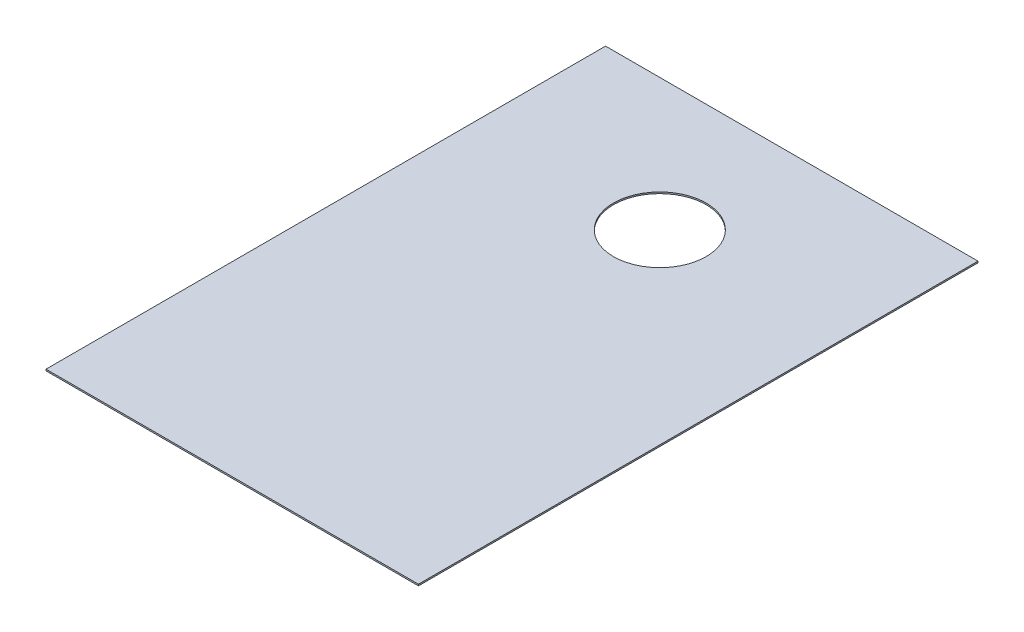
ISO-10303-21;
HEADER;
FILE_DESCRIPTION(('STEP AP214'),'2;1');
FILE_NAME('part.step','',(''),(''),'','','');
FILE_SCHEMA(('AUTOMOTIVE_DESIGN { 1 0 10303 214 1 1 1 1 }'));
ENDSEC;
DATA;
#1=APPLICATION_CONTEXT('core data for automotive mechanical design processes');
#2=APPLICATION_PROTOCOL_DEFINITION('international standard','automotive_design',2000,#1);
#3=PRODUCT_CONTEXT('',#1,'mechanical');
#4=PRODUCT('Part','Part','',(#3));
#5=PRODUCT_RELATED_PRODUCT_CATEGORY('part','',(#4));
#6=PRODUCT_DEFINITION_FORMATION('','',#4);
#7=PRODUCT_DEFINITION_CONTEXT('part definition',#1,'design');
#8=PRODUCT_DEFINITION('design','',#6,#7);
#9=PRODUCT_DEFINITION_SHAPE('','',#8);
#10=(LENGTH_UNIT() NAMED_UNIT(*) SI_UNIT(.MILLI.,.METRE.));
#11=(NAMED_UNIT(*) PLANE_ANGLE_UNIT() SI_UNIT($,.RADIAN.));
#12=(NAMED_UNIT(*) SI_UNIT($,.STERADIAN.) SOLID_ANGLE_UNIT());
#13=UNCERTAINTY_MEASURE_WITH_UNIT(LENGTH_MEASURE(1.E-05),#10,'distance_accuracy_value','');
#14=(GEOMETRIC_REPRESENTATION_CONTEXT(3) GLOBAL_UNCERTAINTY_ASSIGNED_CONTEXT((#13)) GLOBAL_UNIT_ASSIGNED_CONTEXT((#10,
#11,#12)) REPRESENTATION_CONTEXT('',''));
#15=CARTESIAN_POINT('',(0.,0.,0.));
#16=DIRECTION('',(0.,0.,1.));
#17=DIRECTION('',(1.,0.,0.));
#18=AXIS2_PLACEMENT_3D('',#15,#16,#17);
#19=CARTESIAN_POINT('',(6.35,0.051,-9.54));
#20=DIRECTION('',(-1.,0.,0.));
#21=DIRECTION('',(0.,0.,1.));
#22=AXIS2_PLACEMENT_3D('',#19,#20,#21);
#23=PLANE('',#22);
#24=DIRECTION('',(0.,0.,-1.));
#25=VECTOR('',#24,1.);
#26=CARTESIAN_POINT('',(6.35,0.,-9.54));
#27=LINE('',#26,#25);
#28=CARTESIAN_POINT('',(6.35,0.,9.54));
#29=VERTEX_POINT('',#28);
#30=CARTESIAN_POINT('',(6.35,0.,-9.54));
#31=VERTEX_POINT('',#30);
#32=EDGE_CURVE('E107',#29,#31,#27,.T.);
#33=ORIENTED_EDGE('',*,*,#32,.T.);
#34=DIRECTION('',(0.,-1.,0.));
#35=VECTOR('',#34,1.);
#36=CARTESIAN_POINT('',(6.35,0.051,-9.54));
#37=LINE('',#36,#35);
#38=CARTESIAN_POINT('',(6.35,0.051,-9.54));
#39=VERTEX_POINT('',#38);
#40=EDGE_CURVE('E11',#39,#31,#37,.T.);
#41=ORIENTED_EDGE('',*,*,#40,.F.);
#42=DIRECTION('',(0.,0.,-1.));
#43=VECTOR('',#42,1.);
#44=CARTESIAN_POINT('',(6.35,0.051,-9.54));
#45=LINE('',#44,#43);
#46=CARTESIAN_POINT('',(6.35,0.051,9.54));
#47=VERTEX_POINT('',#46);
#48=EDGE_CURVE('E91',#47,#39,#45,.T.);
#49=ORIENTED_EDGE('',*,*,#48,.F.);
#50=DIRECTION('',(0.,-1.,0.));
#51=VECTOR('',#50,1.);
#52=CARTESIAN_POINT('',(6.35,0.051,9.54));
#53=LINE('',#52,#51);
#54=EDGE_CURVE('E103',#47,#29,#53,.T.);
#55=ORIENTED_EDGE('',*,*,#54,.T.);
#56=EDGE_LOOP('',(#33,#41,#49,#55));
#57=FACE_BOUND('',#56,.T.);
#58=ADVANCED_FACE('F39',(#57),#23,.F.);
#59=CARTESIAN_POINT('',(-6.35,0.051,-9.54));
#60=DIRECTION('',(0.,0.,1.));
#61=DIRECTION('',(1.,0.,0.));
#62=AXIS2_PLACEMENT_3D('',#59,#60,#61);
#63=PLANE('',#62);
#64=DIRECTION('',(-1.,0.,0.));
#65=VECTOR('',#64,1.);
#66=CARTESIAN_POINT('',(-6.35,0.,-9.54));
#67=LINE('',#66,#65);
#68=CARTESIAN_POINT('',(-6.35,0.,-9.54));
#69=VERTEX_POINT('',#68);
#70=EDGE_CURVE('E96',#31,#69,#67,.T.);
#71=ORIENTED_EDGE('',*,*,#70,.T.);
#72=DIRECTION('',(0.,-1.,0.));
#73=VECTOR('',#72,1.);
#74=CARTESIAN_POINT('',(-6.35,0.051,-9.54));
#75=LINE('',#74,#73);
#76=CARTESIAN_POINT('',(-6.35,0.051,-9.54));
#77=VERTEX_POINT('',#76);
#78=EDGE_CURVE('E48',#77,#69,#75,.T.);
#79=ORIENTED_EDGE('',*,*,#78,.F.);
#80=DIRECTION('',(-1.,0.,0.));
#81=VECTOR('',#80,1.);
#82=CARTESIAN_POINT('',(-6.35,0.051,-9.54));
#83=LINE('',#82,#81);
#84=EDGE_CURVE('E86',#39,#77,#83,.T.);
#85=ORIENTED_EDGE('',*,*,#84,.F.);
#86=ORIENTED_EDGE('',*,*,#40,.T.);
#87=EDGE_LOOP('',(#71,#79,#85,#86));
#88=FACE_BOUND('',#87,.T.);
#89=ADVANCED_FACE('F95',(#88),#63,.F.);
#90=CARTESIAN_POINT('',(-6.35,0.051,-9.54));
#91=DIRECTION('',(1.,0.,0.));
#92=DIRECTION('',(0.,0.,-1.));
#93=AXIS2_PLACEMENT_3D('',#90,#91,#92);
#94=PLANE('',#93);
#95=DIRECTION('',(0.,0.,1.));
#96=VECTOR('',#95,1.);
#97=CARTESIAN_POINT('',(-6.35,0.,-9.54));
#98=LINE('',#97,#96);
#99=CARTESIAN_POINT('',(-6.35,0.,9.54));
#100=VERTEX_POINT('',#99);
#101=EDGE_CURVE('E73',#69,#100,#98,.T.);
#102=ORIENTED_EDGE('',*,*,#101,.T.);
#103=DIRECTION('',(0.,-1.,0.));
#104=VECTOR('',#103,1.);
#105=CARTESIAN_POINT('',(-6.35,0.051,9.54));
#106=LINE('',#105,#104);
#107=CARTESIAN_POINT('',(-6.35,0.051,9.54));
#108=VERTEX_POINT('',#107);
#109=EDGE_CURVE('E98',#108,#100,#106,.T.);
#110=ORIENTED_EDGE('',*,*,#109,.F.);
#111=DIRECTION('',(0.,0.,1.));
#112=VECTOR('',#111,1.);
#113=CARTESIAN_POINT('',(-6.35,0.051,-9.54));
#114=LINE('',#113,#112);
#115=EDGE_CURVE('E89',#77,#108,#114,.T.);
#116=ORIENTED_EDGE('',*,*,#115,.F.);
#117=ORIENTED_EDGE('',*,*,#78,.T.);
#118=EDGE_LOOP('',(#102,#110,#116,#117));
#119=FACE_BOUND('',#118,.T.);
#120=ADVANCED_FACE('F99',(#119),#94,.F.);
#121=CARTESIAN_POINT('',(-6.35,0.051,9.54));
#122=DIRECTION('',(0.,0.,-1.));
#123=DIRECTION('',(-1.,0.,0.));
#124=AXIS2_PLACEMENT_3D('',#121,#122,#123);
#125=PLANE('',#124);
#126=DIRECTION('',(1.,0.,0.));
#127=VECTOR('',#126,1.);
#128=CARTESIAN_POINT('',(-6.35,0.,9.54));
#129=LINE('',#128,#127);
#130=EDGE_CURVE('E79',#100,#29,#129,.T.);
#131=ORIENTED_EDGE('',*,*,#130,.T.);
#132=ORIENTED_EDGE('',*,*,#54,.F.);
#133=DIRECTION('',(1.,0.,0.));
#134=VECTOR('',#133,1.);
#135=CARTESIAN_POINT('',(-6.35,0.051,9.54));
#136=LINE('',#135,#134);
#137=EDGE_CURVE('E56',#108,#47,#136,.T.);
#138=ORIENTED_EDGE('',*,*,#137,.F.);
#139=ORIENTED_EDGE('',*,*,#109,.T.);
#140=EDGE_LOOP('',(#131,#132,#138,#139));
#141=FACE_BOUND('',#140,.T.);
#142=ADVANCED_FACE('F121',(#141),#125,.F.);
#143=CARTESIAN_POINT('',(0.,0.051,0.));
#144=DIRECTION('',(0.,1.,0.));
#145=DIRECTION('',(0.,0.,1.));
#146=AXIS2_PLACEMENT_3D('',#143,#144,#145);
#147=PLANE('',#146);
#148=CARTESIAN_POINT('',(0.,0.051,-5.04));
#149=DIRECTION('',(0.,1.,0.));
#150=DIRECTION('',(0.,0.,1.));
#151=AXIS2_PLACEMENT_3D('',#148,#149,#150);
#152=CIRCLE('',#151,1.58181761986657);
#153=CARTESIAN_POINT('',(0.,0.051,-3.45818238013343));
#154=VERTEX_POINT('',#153);
#155=EDGE_CURVE('E128',#154,#154,#152,.T.);
#156=ORIENTED_EDGE('',*,*,#155,.F.);
#157=EDGE_LOOP('',(#156));
#158=FACE_BOUND('',#157,.T.);
#159=ORIENTED_EDGE('',*,*,#48,.T.);
#160=ORIENTED_EDGE('',*,*,#84,.T.);
#161=ORIENTED_EDGE('',*,*,#115,.T.);
#162=ORIENTED_EDGE('',*,*,#137,.T.);
#163=EDGE_LOOP('',(#159,#160,#161,#162));
#164=FACE_BOUND('',#163,.T.);
#165=ADVANCED_FACE('F87',(#158,#164),#147,.T.);
#166=CARTESIAN_POINT('',(0.,0.,0.));
#167=DIRECTION('',(0.,1.,0.));
#168=DIRECTION('',(0.,0.,1.));
#169=AXIS2_PLACEMENT_3D('',#166,#167,#168);
#170=PLANE('',#169);
#171=CARTESIAN_POINT('',(0.,0.,-5.04));
#172=DIRECTION('',(0.,1.,0.));
#173=DIRECTION('',(0.,0.,1.));
#174=AXIS2_PLACEMENT_3D('',#171,#172,#173);
#175=CIRCLE('',#174,1.58181761986657);
#176=CARTESIAN_POINT('',(0.,0.,-3.45818238013343));
#177=VERTEX_POINT('',#176);
#178=EDGE_CURVE('E111',#177,#177,#175,.T.);
#179=ORIENTED_EDGE('',*,*,#178,.T.);
#180=EDGE_LOOP('',(#179));
#181=FACE_BOUND('',#180,.T.);
#182=ORIENTED_EDGE('',*,*,#32,.F.);
#183=ORIENTED_EDGE('',*,*,#130,.F.);
#184=ORIENTED_EDGE('',*,*,#101,.F.);
#185=ORIENTED_EDGE('',*,*,#70,.F.);
#186=EDGE_LOOP('',(#182,#183,#184,#185));
#187=FACE_BOUND('',#186,.T.);
#188=ADVANCED_FACE('F124',(#181,#187),#170,.F.);
#189=CARTESIAN_POINT('',(0.,0.,-5.04));
#190=DIRECTION('',(0.,1.,0.));
#191=DIRECTION('',(0.,0.,1.));
#192=AXIS2_PLACEMENT_3D('',#189,#190,#191);
#193=CYLINDRICAL_SURFACE('',#192,1.58181761986657);
#194=ORIENTED_EDGE('',*,*,#178,.F.);
#195=EDGE_LOOP('',(#194));
#196=FACE_BOUND('',#195,.T.);
#197=ORIENTED_EDGE('',*,*,#155,.T.);
#198=EDGE_LOOP('',(#197));
#199=FACE_BOUND('',#198,.T.);
#200=ADVANCED_FACE('F137',(#196,#199),#193,.F.);
#201=CLOSED_SHELL('',(#58,#89,#120,#142,#165,#188,#200));
#202=MANIFOLD_SOLID_BREP('B2',#201);
#203=ADVANCED_BREP_SHAPE_REPRESENTATION('',(#18,#202),#14);
#204=SHAPE_DEFINITION_REPRESENTATION(#9,#203);
ENDSEC;
END-ISO-10303-21;
